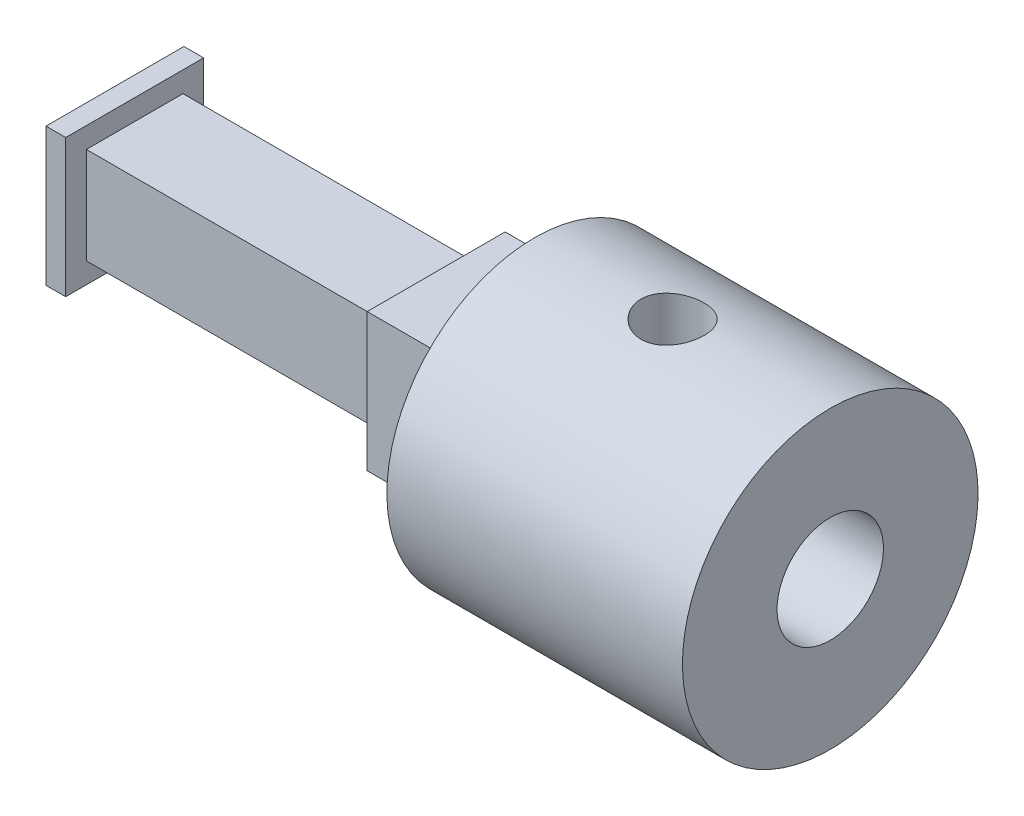
ISO-10303-21;
HEADER;
FILE_DESCRIPTION(('STEP AP214'),'2;1');
FILE_NAME('part.step','',(''),(''),'','','');
FILE_SCHEMA(('AUTOMOTIVE_DESIGN { 1 0 10303 214 1 1 1 1 }'));
ENDSEC;
DATA;
#1=APPLICATION_CONTEXT('core data for automotive mechanical design processes');
#2=APPLICATION_PROTOCOL_DEFINITION('international standard','automotive_design',2000,#1);
#3=PRODUCT_CONTEXT('',#1,'mechanical');
#4=PRODUCT('Part','Part','',(#3));
#5=PRODUCT_RELATED_PRODUCT_CATEGORY('part','',(#4));
#6=PRODUCT_DEFINITION_FORMATION('','',#4);
#7=PRODUCT_DEFINITION_CONTEXT('part definition',#1,'design');
#8=PRODUCT_DEFINITION('design','',#6,#7);
#9=PRODUCT_DEFINITION_SHAPE('','',#8);
#10=(LENGTH_UNIT() NAMED_UNIT(*) SI_UNIT(.MILLI.,.METRE.));
#11=(NAMED_UNIT(*) PLANE_ANGLE_UNIT() SI_UNIT($,.RADIAN.));
#12=(NAMED_UNIT(*) SI_UNIT($,.STERADIAN.) SOLID_ANGLE_UNIT());
#13=UNCERTAINTY_MEASURE_WITH_UNIT(LENGTH_MEASURE(1.E-05),#10,'distance_accuracy_value','');
#14=(GEOMETRIC_REPRESENTATION_CONTEXT(3) GLOBAL_UNCERTAINTY_ASSIGNED_CONTEXT((#13)) GLOBAL_UNIT_ASSIGNED_CONTEXT((#10,
#11,#12)) REPRESENTATION_CONTEXT('',''));
#15=CARTESIAN_POINT('',(0.,0.,0.));
#16=DIRECTION('',(0.,0.,1.));
#17=DIRECTION('',(1.,0.,0.));
#18=AXIS2_PLACEMENT_3D('',#15,#16,#17);
#19=CARTESIAN_POINT('',(15.,0.,0.));
#20=DIRECTION('',(1.,0.,0.));
#21=DIRECTION('',(0.,1.,0.));
#22=AXIS2_PLACEMENT_3D('',#19,#20,#21);
#23=CYLINDRICAL_SURFACE('',#22,7.5);
#24=CARTESIAN_POINT('',(15.,0.,0.));
#25=DIRECTION('',(1.,0.,0.));
#26=DIRECTION('',(0.,1.,0.));
#27=AXIS2_PLACEMENT_3D('',#24,#25,#26);
#28=CIRCLE('',#27,7.5);
#29=CARTESIAN_POINT('',(15.,7.5,0.));
#30=VERTEX_POINT('',#29);
#31=EDGE_CURVE('E11',#30,#30,#28,.T.);
#32=ORIENTED_EDGE('',*,*,#31,.F.);
#33=EDGE_LOOP('',(#32));
#34=FACE_BOUND('',#33,.T.);
#35=CARTESIAN_POINT('',(0.,0.,0.));
#36=DIRECTION('',(1.,0.,0.));
#37=DIRECTION('',(0.,1.,0.));
#38=AXIS2_PLACEMENT_3D('',#35,#36,#37);
#39=CIRCLE('',#38,7.50000000000001);
#40=CARTESIAN_POINT('',(0.,7.5,0.));
#41=VERTEX_POINT('',#40);
#42=EDGE_CURVE('E53',#41,#41,#39,.T.);
#43=ORIENTED_EDGE('',*,*,#42,.T.);
#44=EDGE_LOOP('',(#43));
#45=FACE_BOUND('',#44,.T.);
#46=CARTESIAN_POINT('',(5.4,7.5,0.));
#47=CARTESIAN_POINT('',(5.40000310580464,7.4999983570598,-0.0887944293338556));
#48=CARTESIAN_POINT('',(5.40741663447956,7.49840703800838,-0.177626889700681));
#49=CARTESIAN_POINT('',(5.43684623857203,7.49221258982039,-0.352772204992273));
#50=CARTESIAN_POINT('',(5.45887309457672,7.48760723719598,-0.439083150622767));
#51=CARTESIAN_POINT('',(5.51681095195386,7.47589793294748,-0.60662858018066));
#52=CARTESIAN_POINT('',(5.55270780512143,7.46879652810656,-0.687868139445262));
#53=CARTESIAN_POINT('',(5.63732260760266,7.45286320133508,-0.843167757727072));
#54=CARTESIAN_POINT('',(5.68604009833691,7.4440313413038,-0.917228073407921));
#55=CARTESIAN_POINT('',(5.79570283046542,7.42545480782522,-1.05720419368928));
#56=CARTESIAN_POINT('',(5.85680663310305,7.41569927510424,-1.12299434543086));
#57=CARTESIAN_POINT('',(5.989166936086,7.39645215099328,-1.24347351522622));
#58=CARTESIAN_POINT('',(6.06042430620221,7.38696058229821,-1.29816158128342));
#59=CARTESIAN_POINT('',(6.21199059505989,7.3692093095156,-1.39543277767187));
#60=CARTESIAN_POINT('',(6.29238644331646,7.36096353805546,-1.43788322502763));
#61=CARTESIAN_POINT('',(6.45937531689855,7.34679287525929,-1.50862340101052));
#62=CARTESIAN_POINT('',(6.54596763859659,7.34086772090353,-1.53691473453874));
#63=CARTESIAN_POINT('',(6.72153161911032,7.33211955105285,-1.57812049535871));
#64=CARTESIAN_POINT('',(6.81044892540796,7.32925182047022,-1.59125680705956));
#65=CARTESIAN_POINT('',(6.98926804415069,7.32680881403604,-1.60246934089929));
#66=CARTESIAN_POINT('',(7.07916974044717,7.32723315384411,-1.60054732105774));
#67=CARTESIAN_POINT('',(7.25576395551687,7.33128581769295,-1.58187655808685));
#68=CARTESIAN_POINT('',(7.3424850841123,7.33485865843677,-1.56538455643806));
#69=CARTESIAN_POINT('',(7.51190065169833,7.34471814062501,-1.51844828834833));
#70=CARTESIAN_POINT('',(7.59459487441691,7.35100492764819,-1.48800327344863));
#71=CARTESIAN_POINT('',(7.75433637344019,7.36563922179753,-1.41378668233803));
#72=CARTESIAN_POINT('',(7.8313359047914,7.37400204199821,-1.36991548636568));
#73=CARTESIAN_POINT('',(7.97697571322877,7.39183660364213,-1.27016199217251));
#74=CARTESIAN_POINT('',(8.0456149017451,7.40130848917848,-1.21427813244002));
#75=CARTESIAN_POINT('',(8.17406475391846,7.4205326849195,-1.09072196751541));
#76=CARTESIAN_POINT('',(8.23366511786383,7.43028675890513,-1.02283110172082));
#77=CARTESIAN_POINT('',(8.34066741368746,7.44879883076769,-0.877908758701802));
#78=CARTESIAN_POINT('',(8.38806914497592,7.45755681226393,-0.800877131200498));
#79=CARTESIAN_POINT('',(8.46937667500744,7.4731161994162,-0.639610081827263));
#80=CARTESIAN_POINT('',(8.50325596228198,7.47991375438739,-0.555360898326548));
#81=CARTESIAN_POINT('',(8.55631934120428,7.49075760800742,-0.382188547319413));
#82=CARTESIAN_POINT('',(8.57550546346589,7.49480428682212,-0.293266027489786));
#83=CARTESIAN_POINT('',(8.59833443018386,7.49963667143352,-0.115076046551737));
#84=CARTESIAN_POINT('',(8.60226469968599,7.50048267119555,-0.0258469966592106));
#85=CARTESIAN_POINT('',(8.5952479687875,7.49898689492793,0.151992686527999));
#86=CARTESIAN_POINT('',(8.58430192583436,7.49664532405204,0.240603359252846));
#87=CARTESIAN_POINT('',(8.54808177478368,7.48907546339841,0.413746062380253));
#88=CARTESIAN_POINT('',(8.52295745147484,7.48387736587364,0.498310863335302));
#89=CARTESIAN_POINT('',(8.45925941611984,7.47117587533623,0.662026395792984));
#90=CARTESIAN_POINT('',(8.42068459746211,7.46367229265062,0.741176681186479));
#91=CARTESIAN_POINT('',(8.33057492538175,7.44704294085318,0.893011950773005));
#92=CARTESIAN_POINT('',(8.27886997348518,7.43789638159132,0.965593659738483));
#93=CARTESIAN_POINT('',(8.16419284396975,7.41903990869546,1.10115356003048));
#94=CARTESIAN_POINT('',(8.1012192791882,7.40932992580373,1.16413056725132));
#95=CARTESIAN_POINT('',(7.96447656037231,7.39023419815026,1.27982177561402));
#96=CARTESIAN_POINT('',(7.89053800659192,7.38085708289827,1.33233743532724));
#97=CARTESIAN_POINT('',(7.73472128848835,7.36368318738415,1.42420609305473));
#98=CARTESIAN_POINT('',(7.65284346162947,7.35588633999514,1.46355965021717));
#99=CARTESIAN_POINT('',(7.4839054249434,7.3428278116798,1.52772807228232));
#100=CARTESIAN_POINT('',(7.3968767842295,7.33755218632522,1.55262307368944));
#101=CARTESIAN_POINT('',(7.21974527412033,7.33010689029808,1.58740514879098));
#102=CARTESIAN_POINT('',(7.12964287104898,7.32793675061544,1.59729448874882));
#103=CARTESIAN_POINT('',(6.95092074272307,7.32697666157729,1.60169174862619));
#104=CARTESIAN_POINT('',(6.86230897944379,7.32811760571581,1.59651412882043));
#105=CARTESIAN_POINT('',(6.68725139744788,7.33349539816058,1.57162478005708));
#106=CARTESIAN_POINT('',(6.60080555574664,7.33773221359929,1.55191320540032));
#107=CARTESIAN_POINT('',(6.4327687553766,7.34879149338566,1.49866402761735));
#108=CARTESIAN_POINT('',(6.35116339646566,7.35560579203591,1.46517005919756));
#109=CARTESIAN_POINT('',(6.19468291630875,7.37105584436333,1.38534516691845));
#110=CARTESIAN_POINT('',(6.1198084574469,7.37969177702726,1.33901298148492));
#111=CARTESIAN_POINT('',(5.97736032255051,7.39801997202294,1.23377464987916));
#112=CARTESIAN_POINT('',(5.90995505174662,7.40772937703983,1.17464349733653));
#113=CARTESIAN_POINT('',(5.78592046785693,7.42699305436862,1.0459443480745));
#114=CARTESIAN_POINT('',(5.72929364336273,7.43654729038956,0.976373947694455));
#115=CARTESIAN_POINT('',(5.62776396054319,7.4545622712928,0.827748193968453));
#116=CARTESIAN_POINT('',(5.58301269010891,7.46300824065792,0.748587403501146));
#117=CARTESIAN_POINT('',(5.50752100144343,7.47770774713458,0.583706040029168));
#118=CARTESIAN_POINT('',(5.47676857007093,7.48396316300768,0.497991165498194));
#119=CARTESIAN_POINT('',(5.43577023708618,7.49243099511991,0.34346476310391));
#120=CARTESIAN_POINT('',(5.42238148534867,7.4952520823403,0.275502835649662));
#121=CARTESIAN_POINT('',(5.4044953360015,7.49903718747764,0.138368271279889));
#122=CARTESIAN_POINT('',(5.39999757970994,7.5000012803097,0.0691956833185954));
#123=CARTESIAN_POINT('',(5.4,7.5,0.));
#124=B_SPLINE_CURVE_WITH_KNOTS('',3,(#46,#47,#48,#49,#50,#51,#52,#53,#54,#55,#56,#57,#58,#59,
#60,#61,#62,#63,#64,#65,#66,#67,#68,#69,#70,#71,#72,#73,#74,#75,#76,#77,#78,#79,#80,#81,#82,#83,
#84,#85,#86,#87,#88,#89,#90,#91,#92,#93,#94,#95,#96,#97,#98,#99,#100,#101,#102,#103,#104,#105,
#106,#107,#108,#109,#110,#111,#112,#113,#114,#115,#116,#117,#118,#119,#120,#121,#122,#123),
.UNSPECIFIED.,.T.,.F.,(4,2,2,2,2,2,2,2,2,2,2,2,2,2,2,2,2,2,2,2,2,2,2,2,2,2,2,2,2,2,2,2,2,2,2,2,
2,2,4),(0.,0.266130047854764,0.532456644597194,0.798512286868047,1.0645584139285,
1.33425388789939,1.60397247832158,1.87651399120587,2.14902460517277,2.41749263134366,
2.68592931506412,2.94972810159234,3.2135410403056,3.47936093436643,3.74521540295248,
4.01653060252533,4.28785026321979,4.55969927797482,4.83151071607126,5.09817555204362,
5.36482322613615,5.62870529395039,5.89260907723844,6.1601236003675,6.42767107713312,
6.69989324302714,6.97210384299804,7.24279095265699,7.51343717712195,7.77847555890146,
8.04351112692156,8.30771397733336,8.57194279940304,8.8412611265422,9.11064156026671,
9.38331104903346,9.65574610257702,9.86314417471904,10.0705338798061),.UNSPECIFIED.);
#125=CARTESIAN_POINT('',(5.4,7.5,0.));
#126=VERTEX_POINT('',#125);
#127=EDGE_CURVE('E226',#126,#126,#124,.T.);
#128=ORIENTED_EDGE('',*,*,#127,.T.);
#129=EDGE_LOOP('',(#128));
#130=FACE_BOUND('',#129,.T.);
#131=ADVANCED_FACE('F39',(#34,#45,#130),#23,.T.);
#132=CARTESIAN_POINT('',(5.,0.,0.));
#133=DIRECTION('',(1.,0.,0.));
#134=DIRECTION('',(0.,1.,0.));
#135=AXIS2_PLACEMENT_3D('',#132,#133,#134);
#136=CYLINDRICAL_SURFACE('',#135,2.7);
#137=CARTESIAN_POINT('',(5.,0.,0.));
#138=DIRECTION('',(1.,0.,0.));
#139=DIRECTION('',(0.,1.,0.));
#140=AXIS2_PLACEMENT_3D('',#137,#138,#139);
#141=CIRCLE('',#140,2.7);
#142=CARTESIAN_POINT('',(5.,2.7,0.));
#143=VERTEX_POINT('',#142);
#144=EDGE_CURVE('E233',#143,#143,#141,.T.);
#145=ORIENTED_EDGE('',*,*,#144,.F.);
#146=EDGE_LOOP('',(#145));
#147=FACE_BOUND('',#146,.T.);
#148=CARTESIAN_POINT('',(15.,0.,0.));
#149=DIRECTION('',(1.,0.,0.));
#150=DIRECTION('',(0.,1.,0.));
#151=AXIS2_PLACEMENT_3D('',#148,#149,#150);
#152=CIRCLE('',#151,2.7);
#153=CARTESIAN_POINT('',(15.,2.70000000000001,0.));
#154=VERTEX_POINT('',#153);
#155=EDGE_CURVE('E232',#154,#154,#152,.T.);
#156=ORIENTED_EDGE('',*,*,#155,.T.);
#157=EDGE_LOOP('',(#156));
#158=FACE_BOUND('',#157,.T.);
#159=CARTESIAN_POINT('',(5.4,2.7,0.));
#160=CARTESIAN_POINT('',(5.40000375778761,2.69999658267815,-0.0820065759345029));
#161=CARTESIAN_POINT('',(5.40634924965439,2.69622272848173,-0.164153964713906));
#162=CARTESIAN_POINT('',(5.43141134122259,2.68148664448446,-0.325990974255464));
#163=CARTESIAN_POINT('',(5.45016033536405,2.67050559211505,-0.405673585757346));
#164=CARTESIAN_POINT('',(5.4989878679028,2.64246877845777,-0.559885049219614));
#165=CARTESIAN_POINT('',(5.52901031777516,2.6254431132658,-0.634437288354857));
#166=CARTESIAN_POINT('',(5.5991906377463,2.58677615989445,-0.777217855016618));
#167=CARTESIAN_POINT('',(5.63934556946116,2.56513621012274,-0.845448008096428));
#168=CARTESIAN_POINT('',(5.7320253448909,2.51715482048914,-0.979475127432629));
#169=CARTESIAN_POINT('',(5.7852547009494,2.49058189021379,-1.04470051404402));
#170=CARTESIAN_POINT('',(5.90099545603393,2.43622623895226,-1.16585635861109));
#171=CARTESIAN_POINT('',(5.96351857473198,2.40844202222704,-1.22177488887931));
#172=CARTESIAN_POINT('',(6.10483452035191,2.35088619585746,-1.32946803838828));
#173=CARTESIAN_POINT('',(6.18467794460674,2.32127118038344,-1.37995902242836));
#174=CARTESIAN_POINT('',(6.35345559649618,2.26752532882853,-1.46660848208216));
#175=CARTESIAN_POINT('',(6.44237499882715,2.24338575027536,-1.50278987509542));
#176=CARTESIAN_POINT('',(6.60533497668182,2.20929875641411,-1.55231457696361));
#177=CARTESIAN_POINT('',(6.67792858915867,2.19734585956121,-1.56903376909895));
#178=CARTESIAN_POINT('',(6.8255132960388,2.18061826857277,-1.59220492362556));
#179=CARTESIAN_POINT('',(6.90050141208829,2.17583498658959,-1.59866917005249));
#180=CARTESIAN_POINT('',(7.05086538485511,2.17414951595484,-1.60096125099117));
#181=CARTESIAN_POINT('',(7.12624169544148,2.17726145526209,-1.59677001822351));
#182=CARTESIAN_POINT('',(7.27501054717493,2.19091932628889,-1.57797353824621));
#183=CARTESIAN_POINT('',(7.34840158693976,2.20147072950347,-1.56336062612347));
#184=CARTESIAN_POINT('',(7.4906213667242,2.22842309668515,-1.52468745074616));
#185=CARTESIAN_POINT('',(7.55948946160106,2.24476239361387,-1.50072652297251));
#186=CARTESIAN_POINT('',(7.69241844564634,2.28152454030499,-1.44422281389659));
#187=CARTESIAN_POINT('',(7.75647754072407,2.30194890377046,-1.41167685001811));
#188=CARTESIAN_POINT('',(7.88961481079747,2.34880606915806,-1.33250411129526));
#189=CARTESIAN_POINT('',(7.95767613684827,2.37566897169548,-1.28442085260062));
#190=CARTESIAN_POINT('',(8.08545658326117,2.42999345054903,-1.17842479856575));
#191=CARTESIAN_POINT('',(8.14516784288165,2.45745556322371,-1.12050285317424));
#192=CARTESIAN_POINT('',(8.26255383805854,2.51417219872305,-0.987338750179123));
#193=CARTESIAN_POINT('',(8.31891257455853,2.54318274316713,-0.91081879438025));
#194=CARTESIAN_POINT('',(8.41779339632223,2.59584046864531,-0.747626395505925));
#195=CARTESIAN_POINT('',(8.46032330923402,2.61949068152911,-0.66095973377771));
#196=CARTESIAN_POINT('',(8.52721717440492,2.65738287862152,-0.485618800712077));
#197=CARTESIAN_POINT('',(8.55258254422058,2.67213663542399,-0.397441525809794));
#198=CARTESIAN_POINT('',(8.58785871276424,2.69278380274456,-0.217073540355457));
#199=CARTESIAN_POINT('',(8.59778713853103,2.69868731884248,-0.124887531155625));
#200=CARTESIAN_POINT('',(8.60130365964645,2.70077374040867,0.0476700090999777));
#201=CARTESIAN_POINT('',(8.59687577025273,2.69813695390741,0.127994725082626));
#202=CARTESIAN_POINT('',(8.57615959718169,2.68592781569133,0.286549068999242));
#203=CARTESIAN_POINT('',(8.55987142152316,2.67635552714231,0.36477871600754));
#204=CARTESIAN_POINT('',(8.51668116539754,2.65141845279272,0.515463565598392));
#205=CARTESIAN_POINT('',(8.49000222473875,2.6361757285439,0.588003973606523));
#206=CARTESIAN_POINT('',(8.42705735513513,2.60111714022657,0.727580843015088));
#207=CARTESIAN_POINT('',(8.39078943494211,2.58130032641096,0.794616157433584));
#208=CARTESIAN_POINT('',(8.30547304388301,2.53629851588985,0.928819654179018));
#209=CARTESIAN_POINT('',(8.25548702522133,2.51076941364591,0.995274899068683));
#210=CARTESIAN_POINT('',(8.14624270643641,2.4579633933912,1.11936320660334));
#211=CARTESIAN_POINT('',(8.08697358846173,2.43068445843037,1.17698581934616));
#212=CARTESIAN_POINT('',(7.95214921750988,2.37326887305746,1.28920281973578));
#213=CARTESIAN_POINT('',(7.87548344203693,2.34320355896362,1.34250814999935));
#214=CARTESIAN_POINT('',(7.71285308600724,2.28743493616667,1.43547441388231));
#215=CARTESIAN_POINT('',(7.62689925241158,2.26172667269257,1.47515089947857));
#216=CARTESIAN_POINT('',(7.4668605879665,2.22335440380869,1.53219242695774));
#217=CARTESIAN_POINT('',(7.39422562489831,2.20907202997051,1.55252627119061));
#218=CARTESIAN_POINT('',(7.24585057515142,2.18748315321114,1.5828050506342));
#219=CARTESIAN_POINT('',(7.17011474007951,2.18016741172187,1.59276374615725));
#220=CARTESIAN_POINT('',(7.01738366247047,2.17358449161056,1.60173846769329));
#221=CARTESIAN_POINT('',(6.94038512683266,2.17434354794437,1.60071882504015));
#222=CARTESIAN_POINT('',(6.78780598747254,2.18385333342133,1.58771651797341));
#223=CARTESIAN_POINT('',(6.71222623044911,2.19260868897546,1.57572750701591));
#224=CARTESIAN_POINT('',(6.56753556649325,2.2163295447953,1.54216684255451));
#225=CARTESIAN_POINT('',(6.49828704079401,2.23103576975973,1.5209928884011));
#226=CARTESIAN_POINT('',(6.36423649649984,2.26494607003401,1.47001819505847));
#227=CARTESIAN_POINT('',(6.29943615743496,2.28415183231537,1.4402142193007));
#228=CARTESIAN_POINT('',(6.16540631326276,2.32850732590041,1.36752711003635));
#229=CARTESIAN_POINT('',(6.09704032155887,2.35411695460243,1.32333442227277));
#230=CARTESIAN_POINT('',(5.96802046998995,2.40655418900443,1.2253927642255));
#231=CARTESIAN_POINT('',(5.90737293001527,2.43338276870514,1.17163604814849));
#232=CARTESIAN_POINT('',(5.78601257213965,2.49007249458462,1.04639954897448));
#233=CARTESIAN_POINT('',(5.7267082192972,2.51976994188956,0.97346661363698));
#234=CARTESIAN_POINT('',(5.62114752238189,2.57472406499812,0.817100566298826));
#235=CARTESIAN_POINT('',(5.57489506248047,2.59997941801841,0.733664339236475));
#236=CARTESIAN_POINT('',(5.49898617673734,2.64236447038059,0.561651288056165));
#237=CARTESIAN_POINT('',(5.46875874999721,2.65976986251062,0.473396592929862));
#238=CARTESIAN_POINT('',(5.42410327538138,2.68572416938139,0.291909898058041));
#239=CARTESIAN_POINT('',(5.4096148884078,2.69430690089503,0.19869835438644));
#240=CARTESIAN_POINT('',(5.4022970334873,2.69863962981062,0.0874938538840498));
#241=CARTESIAN_POINT('',(5.40143658696156,2.69914892368181,0.0700120670624795));
#242=CARTESIAN_POINT('',(5.4002876626063,2.69982947744164,0.0350223281895094));
#243=CARTESIAN_POINT('',(5.39999919743871,2.70000072984706,0.0175143755674633));
#244=CARTESIAN_POINT('',(5.4,2.7,0.));
#245=B_SPLINE_CURVE_WITH_KNOTS('',3,(#159,#160,#161,#162,#163,#164,#165,#166,#167,#168,#169,
#170,#171,#172,#173,#174,#175,#176,#177,#178,#179,#180,#181,#182,#183,#184,#185,#186,#187,#188,
#189,#190,#191,#192,#193,#194,#195,#196,#197,#198,#199,#200,#201,#202,#203,#204,#205,#206,#207,
#208,#209,#210,#211,#212,#213,#214,#215,#216,#217,#218,#219,#220,#221,#222,#223,#224,#225,#226,
#227,#228,#229,#230,#231,#232,#233,#234,#235,#236,#237,#238,#239,#240,#241,#242,#243,#244),
.UNSPECIFIED.,.T.,.F.,(4,2,2,2,2,2,2,2,2,2,2,2,2,2,2,2,2,2,2,2,2,2,2,2,2,2,2,2,2,2,2,2,2,2,2,2,
2,2,2,2,2,2,4),(0.,0.245943988945067,0.492532863358398,0.737910805210248,0.983217669941829,
1.24702487570154,1.51116761647021,1.80672286802455,2.10180284006338,2.3271795998603,
2.55228618442905,2.77779586584492,3.00347157587969,3.22681177320269,3.45023488206726,
3.71188925448079,3.97378831322674,4.27035751297493,4.566758549685,4.8438860363555,
5.12069684545886,5.36096692214289,5.60123481056968,5.83660469244959,6.07202348969775,
6.33195483303842,6.59219136665418,6.88510907164915,7.1776914069416,7.40703763670924,
7.63607930130574,7.86586534718179,8.09578442442367,8.31661123710231,8.5375209752837,
8.79257570318706,9.04783794509579,9.34213811171892,9.6365257683081,9.91956569164145,
10.2015166470152,10.2540424352063,10.3065693861472),.UNSPECIFIED.);
#246=CARTESIAN_POINT('',(5.4,2.7,0.));
#247=VERTEX_POINT('',#246);
#248=EDGE_CURVE('E43',#247,#247,#245,.T.);
#249=ORIENTED_EDGE('',*,*,#248,.F.);
#250=EDGE_LOOP('',(#249));
#251=FACE_BOUND('',#250,.T.);
#252=ADVANCED_FACE('F250',(#147,#158,#251),#136,.F.);
#253=CARTESIAN_POINT('',(15.,0.,0.));
#254=DIRECTION('',(1.,0.,0.));
#255=DIRECTION('',(0.,1.,0.));
#256=AXIS2_PLACEMENT_3D('',#253,#254,#255);
#257=PLANE('',#256);
#258=ORIENTED_EDGE('',*,*,#155,.F.);
#259=EDGE_LOOP('',(#258));
#260=FACE_BOUND('',#259,.T.);
#261=ORIENTED_EDGE('',*,*,#31,.T.);
#262=EDGE_LOOP('',(#261));
#263=FACE_BOUND('',#262,.T.);
#264=ADVANCED_FACE('F41',(#260,#263),#257,.T.);
#265=CARTESIAN_POINT('',(0.,0.,0.));
#266=DIRECTION('',(-1.,0.,0.));
#267=DIRECTION('',(0.,-1.,0.));
#268=AXIS2_PLACEMENT_3D('',#265,#266,#267);
#269=PLANE('',#268);
#270=DIRECTION('',(0.,-1.,0.));
#271=VECTOR('',#270,1.);
#272=CARTESIAN_POINT('',(0.,-3.5,-3.5));
#273=LINE('',#272,#271);
#274=CARTESIAN_POINT('',(0.,3.5,-3.5));
#275=VERTEX_POINT('',#274);
#276=CARTESIAN_POINT('',(0.,-3.5,-3.5));
#277=VERTEX_POINT('',#276);
#278=EDGE_CURVE('E193',#275,#277,#273,.T.);
#279=ORIENTED_EDGE('',*,*,#278,.F.);
#280=DIRECTION('',(0.,0.,-1.));
#281=VECTOR('',#280,1.);
#282=CARTESIAN_POINT('',(0.,3.5,3.5));
#283=LINE('',#282,#281);
#284=CARTESIAN_POINT('',(0.,3.5,3.5));
#285=VERTEX_POINT('',#284);
#286=EDGE_CURVE('E198',#285,#275,#283,.T.);
#287=ORIENTED_EDGE('',*,*,#286,.F.);
#288=DIRECTION('',(0.,1.,0.));
#289=VECTOR('',#288,1.);
#290=CARTESIAN_POINT('',(0.,-3.5,3.5));
#291=LINE('',#290,#289);
#292=CARTESIAN_POINT('',(0.,-3.5,3.5));
#293=VERTEX_POINT('',#292);
#294=EDGE_CURVE('E210',#293,#285,#291,.T.);
#295=ORIENTED_EDGE('',*,*,#294,.F.);
#296=DIRECTION('',(0.,0.,1.));
#297=VECTOR('',#296,1.);
#298=CARTESIAN_POINT('',(0.,-3.5,3.5));
#299=LINE('',#298,#297);
#300=EDGE_CURVE('E207',#277,#293,#299,.T.);
#301=ORIENTED_EDGE('',*,*,#300,.F.);
#302=EDGE_LOOP('',(#279,#287,#295,#301));
#303=FACE_BOUND('',#302,.T.);
#304=ORIENTED_EDGE('',*,*,#42,.F.);
#305=EDGE_LOOP('',(#304));
#306=FACE_BOUND('',#305,.T.);
#307=ADVANCED_FACE('F248',(#303,#306),#269,.T.);
#308=CARTESIAN_POINT('',(5.,0.,0.));
#309=DIRECTION('',(1.,0.,0.));
#310=DIRECTION('',(0.,1.,0.));
#311=AXIS2_PLACEMENT_3D('',#308,#309,#310);
#312=PLANE('',#311);
#313=ORIENTED_EDGE('',*,*,#144,.T.);
#314=EDGE_LOOP('',(#313));
#315=FACE_BOUND('',#314,.T.);
#316=ADVANCED_FACE('F243',(#315),#312,.T.);
#317=CARTESIAN_POINT('',(7.,11.,0.));
#318=DIRECTION('',(0.,-1.,0.));
#319=DIRECTION('',(0.,0.,-1.));
#320=AXIS2_PLACEMENT_3D('',#317,#318,#319);
#321=CYLINDRICAL_SURFACE('',#320,1.6);
#322=ORIENTED_EDGE('',*,*,#127,.F.);
#323=EDGE_LOOP('',(#322));
#324=FACE_BOUND('',#323,.T.);
#325=ORIENTED_EDGE('',*,*,#248,.T.);
#326=EDGE_LOOP('',(#325));
#327=FACE_BOUND('',#326,.T.);
#328=ADVANCED_FACE('F237',(#324,#327),#321,.F.);
#329=CARTESIAN_POINT('',(-5.,-3.5,-3.5));
#330=DIRECTION('',(0.,0.,1.));
#331=DIRECTION('',(1.,0.,0.));
#332=AXIS2_PLACEMENT_3D('',#329,#330,#331);
#333=PLANE('',#332);
#334=ORIENTED_EDGE('',*,*,#278,.T.);
#335=DIRECTION('',(1.,0.,0.));
#336=VECTOR('',#335,1.);
#337=CARTESIAN_POINT('',(-5.,-3.5,-3.5));
#338=LINE('',#337,#336);
#339=CARTESIAN_POINT('',(-5.,-3.5,-3.5));
#340=VERTEX_POINT('',#339);
#341=EDGE_CURVE('E223',#340,#277,#338,.T.);
#342=ORIENTED_EDGE('',*,*,#341,.F.);
#343=DIRECTION('',(0.,-1.,0.));
#344=VECTOR('',#343,1.);
#345=CARTESIAN_POINT('',(-5.,-3.5,-3.5));
#346=LINE('',#345,#344);
#347=CARTESIAN_POINT('',(-5.,3.5,-3.5));
#348=VERTEX_POINT('',#347);
#349=EDGE_CURVE('E194',#348,#340,#346,.T.);
#350=ORIENTED_EDGE('',*,*,#349,.F.);
#351=DIRECTION('',(1.,0.,0.));
#352=VECTOR('',#351,1.);
#353=CARTESIAN_POINT('',(-5.,3.5,-3.5));
#354=LINE('',#353,#352);
#355=EDGE_CURVE('E204',#348,#275,#354,.T.);
#356=ORIENTED_EDGE('',*,*,#355,.T.);
#357=EDGE_LOOP('',(#334,#342,#350,#356));
#358=FACE_BOUND('',#357,.T.);
#359=ADVANCED_FACE('F242',(#358),#333,.F.);
#360=CARTESIAN_POINT('',(-5.,-3.5,3.5));
#361=DIRECTION('',(0.,1.,0.));
#362=DIRECTION('',(-1.,0.,0.));
#363=AXIS2_PLACEMENT_3D('',#360,#361,#362);
#364=PLANE('',#363);
#365=ORIENTED_EDGE('',*,*,#300,.T.);
#366=DIRECTION('',(1.,0.,0.));
#367=VECTOR('',#366,1.);
#368=CARTESIAN_POINT('',(-5.,-3.5,3.5));
#369=LINE('',#368,#367);
#370=CARTESIAN_POINT('',(-5.,-3.5,3.5));
#371=VERTEX_POINT('',#370);
#372=EDGE_CURVE('E220',#371,#293,#369,.T.);
#373=ORIENTED_EDGE('',*,*,#372,.F.);
#374=DIRECTION('',(0.,0.,1.));
#375=VECTOR('',#374,1.);
#376=CARTESIAN_POINT('',(-5.,-3.5,3.5));
#377=LINE('',#376,#375);
#378=EDGE_CURVE('E197',#340,#371,#377,.T.);
#379=ORIENTED_EDGE('',*,*,#378,.F.);
#380=ORIENTED_EDGE('',*,*,#341,.T.);
#381=EDGE_LOOP('',(#365,#373,#379,#380));
#382=FACE_BOUND('',#381,.T.);
#383=ADVANCED_FACE('F312',(#382),#364,.F.);
#384=CARTESIAN_POINT('',(-5.,-3.5,3.5));
#385=DIRECTION('',(0.,0.,-1.));
#386=DIRECTION('',(-1.,0.,0.));
#387=AXIS2_PLACEMENT_3D('',#384,#385,#386);
#388=PLANE('',#387);
#389=ORIENTED_EDGE('',*,*,#294,.T.);
#390=DIRECTION('',(1.,0.,0.));
#391=VECTOR('',#390,1.);
#392=CARTESIAN_POINT('',(-5.,3.5,3.5));
#393=LINE('',#392,#391);
#394=CARTESIAN_POINT('',(-5.,3.5,3.5));
#395=VERTEX_POINT('',#394);
#396=EDGE_CURVE('E217',#395,#285,#393,.T.);
#397=ORIENTED_EDGE('',*,*,#396,.F.);
#398=DIRECTION('',(0.,1.,0.));
#399=VECTOR('',#398,1.);
#400=CARTESIAN_POINT('',(-5.,-3.5,3.5));
#401=LINE('',#400,#399);
#402=EDGE_CURVE('E200',#371,#395,#401,.T.);
#403=ORIENTED_EDGE('',*,*,#402,.F.);
#404=ORIENTED_EDGE('',*,*,#372,.T.);
#405=EDGE_LOOP('',(#389,#397,#403,#404));
#406=FACE_BOUND('',#405,.T.);
#407=ADVANCED_FACE('F319',(#406),#388,.F.);
#408=CARTESIAN_POINT('',(-5.,3.5,3.5));
#409=DIRECTION('',(0.,-1.,0.));
#410=DIRECTION('',(1.,0.,0.));
#411=AXIS2_PLACEMENT_3D('',#408,#409,#410);
#412=PLANE('',#411);
#413=ORIENTED_EDGE('',*,*,#286,.T.);
#414=ORIENTED_EDGE('',*,*,#355,.F.);
#415=DIRECTION('',(0.,0.,-1.));
#416=VECTOR('',#415,1.);
#417=CARTESIAN_POINT('',(-5.,3.5,3.5));
#418=LINE('',#417,#416);
#419=EDGE_CURVE('E202',#395,#348,#418,.T.);
#420=ORIENTED_EDGE('',*,*,#419,.F.);
#421=ORIENTED_EDGE('',*,*,#396,.T.);
#422=EDGE_LOOP('',(#413,#414,#420,#421));
#423=FACE_BOUND('',#422,.T.);
#424=ADVANCED_FACE('F326',(#423),#412,.F.);
#425=CARTESIAN_POINT('',(-5.,0.,0.));
#426=DIRECTION('',(-1.,0.,0.));
#427=DIRECTION('',(0.,-1.,0.));
#428=AXIS2_PLACEMENT_3D('',#425,#426,#427);
#429=PLANE('',#428);
#430=DIRECTION('',(0.,1.,0.));
#431=VECTOR('',#430,1.);
#432=CARTESIAN_POINT('',(-5.,-2.45,2.45));
#433=LINE('',#432,#431);
#434=CARTESIAN_POINT('',(-5.,-2.45,2.45));
#435=VERTEX_POINT('',#434);
#436=CARTESIAN_POINT('',(-5.,2.45,2.45));
#437=VERTEX_POINT('',#436);
#438=EDGE_CURVE('E60',#435,#437,#433,.T.);
#439=ORIENTED_EDGE('',*,*,#438,.F.);
#440=DIRECTION('',(0.,0.,1.));
#441=VECTOR('',#440,1.);
#442=CARTESIAN_POINT('',(-5.,-2.45,-2.45));
#443=LINE('',#442,#441);
#444=CARTESIAN_POINT('',(-5.,-2.45,-2.45));
#445=VERTEX_POINT('',#444);
#446=EDGE_CURVE('E64',#445,#435,#443,.T.);
#447=ORIENTED_EDGE('',*,*,#446,.F.);
#448=DIRECTION('',(0.,-1.,0.));
#449=VECTOR('',#448,1.);
#450=CARTESIAN_POINT('',(-5.,-2.45,-2.45));
#451=LINE('',#450,#449);
#452=CARTESIAN_POINT('',(-5.,2.45,-2.45));
#453=VERTEX_POINT('',#452);
#454=EDGE_CURVE('E179',#453,#445,#451,.T.);
#455=ORIENTED_EDGE('',*,*,#454,.F.);
#456=DIRECTION('',(0.,0.,-1.));
#457=VECTOR('',#456,1.);
#458=CARTESIAN_POINT('',(-5.,2.45,-2.45));
#459=LINE('',#458,#457);
#460=EDGE_CURVE('E158',#437,#453,#459,.T.);
#461=ORIENTED_EDGE('',*,*,#460,.F.);
#462=EDGE_LOOP('',(#439,#447,#455,#461));
#463=FACE_BOUND('',#462,.T.);
#464=ORIENTED_EDGE('',*,*,#349,.T.);
#465=ORIENTED_EDGE('',*,*,#378,.T.);
#466=ORIENTED_EDGE('',*,*,#402,.T.);
#467=ORIENTED_EDGE('',*,*,#419,.T.);
#468=EDGE_LOOP('',(#464,#465,#466,#467));
#469=FACE_BOUND('',#468,.T.);
#470=ADVANCED_FACE('F334',(#463,#469),#429,.T.);
#471=CARTESIAN_POINT('',(-20.3,-2.45000000000001,2.45));
#472=DIRECTION('',(0.,0.,-1.));
#473=DIRECTION('',(-1.,0.,0.));
#474=AXIS2_PLACEMENT_3D('',#471,#472,#473);
#475=PLANE('',#474);
#476=ORIENTED_EDGE('',*,*,#438,.T.);
#477=DIRECTION('',(1.,0.,0.));
#478=VECTOR('',#477,1.);
#479=CARTESIAN_POINT('',(-20.3,2.44999999999999,2.45));
#480=LINE('',#479,#478);
#481=CARTESIAN_POINT('',(-20.3,2.44999999999999,2.45));
#482=VERTEX_POINT('',#481);
#483=EDGE_CURVE('E190',#482,#437,#480,.T.);
#484=ORIENTED_EDGE('',*,*,#483,.F.);
#485=DIRECTION('',(0.,1.,0.));
#486=VECTOR('',#485,1.);
#487=CARTESIAN_POINT('',(-20.3,-2.45000000000001,2.45));
#488=LINE('',#487,#486);
#489=CARTESIAN_POINT('',(-20.3,-2.45000000000001,2.45));
#490=VERTEX_POINT('',#489);
#491=EDGE_CURVE('E164',#490,#482,#488,.T.);
#492=ORIENTED_EDGE('',*,*,#491,.F.);
#493=DIRECTION('',(1.,0.,0.));
#494=VECTOR('',#493,1.);
#495=CARTESIAN_POINT('',(-20.3,-2.45000000000001,2.45));
#496=LINE('',#495,#494);
#497=EDGE_CURVE('E175',#490,#435,#496,.T.);
#498=ORIENTED_EDGE('',*,*,#497,.T.);
#499=EDGE_LOOP('',(#476,#484,#492,#498));
#500=FACE_BOUND('',#499,.T.);
#501=ADVANCED_FACE('F342',(#500),#475,.F.);
#502=CARTESIAN_POINT('',(-20.3,2.44999999999999,-2.45));
#503=DIRECTION('',(0.,-1.,0.));
#504=DIRECTION('',(1.,0.,0.));
#505=AXIS2_PLACEMENT_3D('',#502,#503,#504);
#506=PLANE('',#505);
#507=ORIENTED_EDGE('',*,*,#460,.T.);
#508=DIRECTION('',(1.,0.,0.));
#509=VECTOR('',#508,1.);
#510=CARTESIAN_POINT('',(-20.3,2.44999999999999,-2.45));
#511=LINE('',#510,#509);
#512=CARTESIAN_POINT('',(-20.3,2.44999999999999,-2.45));
#513=VERTEX_POINT('',#512);
#514=EDGE_CURVE('E187',#513,#453,#511,.T.);
#515=ORIENTED_EDGE('',*,*,#514,.F.);
#516=DIRECTION('',(0.,0.,-1.));
#517=VECTOR('',#516,1.);
#518=CARTESIAN_POINT('',(-20.3,2.44999999999999,-2.45));
#519=LINE('',#518,#517);
#520=EDGE_CURVE('E167',#482,#513,#519,.T.);
#521=ORIENTED_EDGE('',*,*,#520,.F.);
#522=ORIENTED_EDGE('',*,*,#483,.T.);
#523=EDGE_LOOP('',(#507,#515,#521,#522));
#524=FACE_BOUND('',#523,.T.);
#525=ADVANCED_FACE('F349',(#524),#506,.F.);
#526=CARTESIAN_POINT('',(-20.3,-2.45000000000001,-2.45));
#527=DIRECTION('',(0.,0.,1.));
#528=DIRECTION('',(1.,0.,0.));
#529=AXIS2_PLACEMENT_3D('',#526,#527,#528);
#530=PLANE('',#529);
#531=ORIENTED_EDGE('',*,*,#454,.T.);
#532=DIRECTION('',(1.,0.,0.));
#533=VECTOR('',#532,1.);
#534=CARTESIAN_POINT('',(-20.3,-2.45000000000001,-2.45));
#535=LINE('',#534,#533);
#536=CARTESIAN_POINT('',(-20.3,-2.45000000000001,-2.45));
#537=VERTEX_POINT('',#536);
#538=EDGE_CURVE('E184',#537,#445,#535,.T.);
#539=ORIENTED_EDGE('',*,*,#538,.F.);
#540=DIRECTION('',(0.,-1.,0.));
#541=VECTOR('',#540,1.);
#542=CARTESIAN_POINT('',(-20.3,-2.45000000000001,-2.45));
#543=LINE('',#542,#541);
#544=EDGE_CURVE('E170',#513,#537,#543,.T.);
#545=ORIENTED_EDGE('',*,*,#544,.F.);
#546=ORIENTED_EDGE('',*,*,#514,.T.);
#547=EDGE_LOOP('',(#531,#539,#545,#546));
#548=FACE_BOUND('',#547,.T.);
#549=ADVANCED_FACE('F357',(#548),#530,.F.);
#550=CARTESIAN_POINT('',(-20.3,-2.45000000000001,-2.45));
#551=DIRECTION('',(0.,1.,0.));
#552=DIRECTION('',(-1.,0.,0.));
#553=AXIS2_PLACEMENT_3D('',#550,#551,#552);
#554=PLANE('',#553);
#555=ORIENTED_EDGE('',*,*,#446,.T.);
#556=ORIENTED_EDGE('',*,*,#497,.F.);
#557=DIRECTION('',(0.,0.,1.));
#558=VECTOR('',#557,1.);
#559=CARTESIAN_POINT('',(-20.3,-2.45000000000001,-2.45));
#560=LINE('',#559,#558);
#561=EDGE_CURVE('E173',#537,#490,#560,.T.);
#562=ORIENTED_EDGE('',*,*,#561,.F.);
#563=ORIENTED_EDGE('',*,*,#538,.T.);
#564=EDGE_LOOP('',(#555,#556,#562,#563));
#565=FACE_BOUND('',#564,.T.);
#566=ADVANCED_FACE('F365',(#565),#554,.F.);
#567=CARTESIAN_POINT('',(-20.3,0.,0.));
#568=DIRECTION('',(-1.,0.,0.));
#569=DIRECTION('',(0.,-1.,0.));
#570=AXIS2_PLACEMENT_3D('',#567,#568,#569);
#571=PLANE('',#570);
#572=DIRECTION('',(0.,-1.,0.));
#573=VECTOR('',#572,1.);
#574=CARTESIAN_POINT('',(-20.3,-3.50000000000001,-3.5));
#575=LINE('',#574,#573);
#576=CARTESIAN_POINT('',(-20.3,3.49999999999998,-3.5));
#577=VERTEX_POINT('',#576);
#578=CARTESIAN_POINT('',(-20.3,-3.50000000000001,-3.5));
#579=VERTEX_POINT('',#578);
#580=EDGE_CURVE('E156',#577,#579,#575,.T.);
#581=ORIENTED_EDGE('',*,*,#580,.F.);
#582=DIRECTION('',(0.,0.,-1.));
#583=VECTOR('',#582,1.);
#584=CARTESIAN_POINT('',(-20.3,3.49999999999998,3.5));
#585=LINE('',#584,#583);
#586=CARTESIAN_POINT('',(-20.3,3.49999999999998,3.5));
#587=VERTEX_POINT('',#586);
#588=EDGE_CURVE('E152',#587,#577,#585,.T.);
#589=ORIENTED_EDGE('',*,*,#588,.F.);
#590=DIRECTION('',(0.,1.,0.));
#591=VECTOR('',#590,1.);
#592=CARTESIAN_POINT('',(-20.3,-3.50000000000001,3.5));
#593=LINE('',#592,#591);
#594=CARTESIAN_POINT('',(-20.3,-3.50000000000001,3.5));
#595=VERTEX_POINT('',#594);
#596=EDGE_CURVE('E504',#595,#587,#593,.T.);
#597=ORIENTED_EDGE('',*,*,#596,.F.);
#598=DIRECTION('',(0.,0.,1.));
#599=VECTOR('',#598,1.);
#600=CARTESIAN_POINT('',(-20.3,-3.50000000000001,3.5));
#601=LINE('',#600,#599);
#602=EDGE_CURVE('E508',#579,#595,#601,.T.);
#603=ORIENTED_EDGE('',*,*,#602,.F.);
#604=EDGE_LOOP('',(#581,#589,#597,#603));
#605=FACE_BOUND('',#604,.T.);
#606=ORIENTED_EDGE('',*,*,#561,.T.);
#607=ORIENTED_EDGE('',*,*,#491,.T.);
#608=ORIENTED_EDGE('',*,*,#520,.T.);
#609=ORIENTED_EDGE('',*,*,#544,.T.);
#610=EDGE_LOOP('',(#606,#607,#608,#609));
#611=FACE_BOUND('',#610,.T.);
#612=ADVANCED_FACE('F373',(#605,#611),#571,.F.);
#613=CARTESIAN_POINT('',(-21.3,-3.50000000000001,-3.5));
#614=DIRECTION('',(0.,0.,1.));
#615=DIRECTION('',(1.,0.,0.));
#616=AXIS2_PLACEMENT_3D('',#613,#614,#615);
#617=PLANE('',#616);
#618=ORIENTED_EDGE('',*,*,#580,.T.);
#619=DIRECTION('',(1.,0.,0.));
#620=VECTOR('',#619,1.);
#621=CARTESIAN_POINT('',(-21.3,-3.50000000000001,-3.5));
#622=LINE('',#621,#620);
#623=CARTESIAN_POINT('',(-21.3,-3.50000000000001,-3.5));
#624=VERTEX_POINT('',#623);
#625=EDGE_CURVE('E136',#624,#579,#622,.T.);
#626=ORIENTED_EDGE('',*,*,#625,.F.);
#627=DIRECTION('',(0.,-1.,0.));
#628=VECTOR('',#627,1.);
#629=CARTESIAN_POINT('',(-21.3,-3.50000000000001,-3.5));
#630=LINE('',#629,#628);
#631=CARTESIAN_POINT('',(-21.3,3.49999999999998,-3.5));
#632=VERTEX_POINT('',#631);
#633=EDGE_CURVE('E143',#632,#624,#630,.T.);
#634=ORIENTED_EDGE('',*,*,#633,.F.);
#635=DIRECTION('',(1.,0.,0.));
#636=VECTOR('',#635,1.);
#637=CARTESIAN_POINT('',(-21.3,3.49999999999998,-3.5));
#638=LINE('',#637,#636);
#639=EDGE_CURVE('E501',#632,#577,#638,.T.);
#640=ORIENTED_EDGE('',*,*,#639,.T.);
#641=EDGE_LOOP('',(#618,#626,#634,#640));
#642=FACE_BOUND('',#641,.T.);
#643=ADVANCED_FACE('F154',(#642),#617,.F.);
#644=CARTESIAN_POINT('',(-21.3,-3.50000000000001,3.5));
#645=DIRECTION('',(0.,1.,0.));
#646=DIRECTION('',(-1.,0.,0.));
#647=AXIS2_PLACEMENT_3D('',#644,#645,#646);
#648=PLANE('',#647);
#649=ORIENTED_EDGE('',*,*,#602,.T.);
#650=DIRECTION('',(1.,0.,0.));
#651=VECTOR('',#650,1.);
#652=CARTESIAN_POINT('',(-21.3,-3.50000000000001,3.5));
#653=LINE('',#652,#651);
#654=CARTESIAN_POINT('',(-21.3,-3.50000000000001,3.5));
#655=VERTEX_POINT('',#654);
#656=EDGE_CURVE('E139',#655,#595,#653,.T.);
#657=ORIENTED_EDGE('',*,*,#656,.F.);
#658=DIRECTION('',(0.,0.,1.));
#659=VECTOR('',#658,1.);
#660=CARTESIAN_POINT('',(-21.3,-3.50000000000001,3.5));
#661=LINE('',#660,#659);
#662=EDGE_CURVE('E132',#624,#655,#661,.T.);
#663=ORIENTED_EDGE('',*,*,#662,.F.);
#664=ORIENTED_EDGE('',*,*,#625,.T.);
#665=EDGE_LOOP('',(#649,#657,#663,#664));
#666=FACE_BOUND('',#665,.T.);
#667=ADVANCED_FACE('F134',(#666),#648,.F.);
#668=CARTESIAN_POINT('',(-21.3,-3.50000000000001,3.5));
#669=DIRECTION('',(0.,0.,-1.));
#670=DIRECTION('',(-1.,0.,0.));
#671=AXIS2_PLACEMENT_3D('',#668,#669,#670);
#672=PLANE('',#671);
#673=ORIENTED_EDGE('',*,*,#596,.T.);
#674=DIRECTION('',(1.,0.,0.));
#675=VECTOR('',#674,1.);
#676=CARTESIAN_POINT('',(-21.3,3.49999999999998,3.5));
#677=LINE('',#676,#675);
#678=CARTESIAN_POINT('',(-21.3,3.49999999999998,3.5));
#679=VERTEX_POINT('',#678);
#680=EDGE_CURVE('E160',#679,#587,#677,.T.);
#681=ORIENTED_EDGE('',*,*,#680,.F.);
#682=DIRECTION('',(0.,1.,0.));
#683=VECTOR('',#682,1.);
#684=CARTESIAN_POINT('',(-21.3,-3.50000000000001,3.5));
#685=LINE('',#684,#683);
#686=EDGE_CURVE('E142',#655,#679,#685,.T.);
#687=ORIENTED_EDGE('',*,*,#686,.F.);
#688=ORIENTED_EDGE('',*,*,#656,.T.);
#689=EDGE_LOOP('',(#673,#681,#687,#688));
#690=FACE_BOUND('',#689,.T.);
#691=ADVANCED_FACE('F394',(#690),#672,.F.);
#692=CARTESIAN_POINT('',(-21.3,3.49999999999998,3.5));
#693=DIRECTION('',(0.,-1.,0.));
#694=DIRECTION('',(1.,0.,0.));
#695=AXIS2_PLACEMENT_3D('',#692,#693,#694);
#696=PLANE('',#695);
#697=ORIENTED_EDGE('',*,*,#588,.T.);
#698=ORIENTED_EDGE('',*,*,#639,.F.);
#699=DIRECTION('',(0.,0.,-1.));
#700=VECTOR('',#699,1.);
#701=CARTESIAN_POINT('',(-21.3,3.49999999999998,3.5));
#702=LINE('',#701,#700);
#703=EDGE_CURVE('E148',#679,#632,#702,.T.);
#704=ORIENTED_EDGE('',*,*,#703,.F.);
#705=ORIENTED_EDGE('',*,*,#680,.T.);
#706=EDGE_LOOP('',(#697,#698,#704,#705));
#707=FACE_BOUND('',#706,.T.);
#708=ADVANCED_FACE('F401',(#707),#696,.F.);
#709=CARTESIAN_POINT('',(-21.3,0.,0.));
#710=DIRECTION('',(-1.,0.,0.));
#711=DIRECTION('',(0.,-1.,0.));
#712=AXIS2_PLACEMENT_3D('',#709,#710,#711);
#713=PLANE('',#712);
#714=ORIENTED_EDGE('',*,*,#633,.T.);
#715=ORIENTED_EDGE('',*,*,#662,.T.);
#716=ORIENTED_EDGE('',*,*,#686,.T.);
#717=ORIENTED_EDGE('',*,*,#703,.T.);
#718=EDGE_LOOP('',(#714,#715,#716,#717));
#719=FACE_BOUND('',#718,.T.);
#720=ADVANCED_FACE('F146',(#719),#713,.T.);
#721=CLOSED_SHELL('',(#131,#252,#264,#307,#316,#328,#359,#383,#407,#424,#470,#501,#525,#549,
#566,#612,#643,#667,#691,#708,#720));
#722=MANIFOLD_SOLID_BREP('B2',#721);
#723=ADVANCED_BREP_SHAPE_REPRESENTATION('',(#18,#722),#14);
#724=SHAPE_DEFINITION_REPRESENTATION(#9,#723);
ENDSEC;
END-ISO-10303-21;
